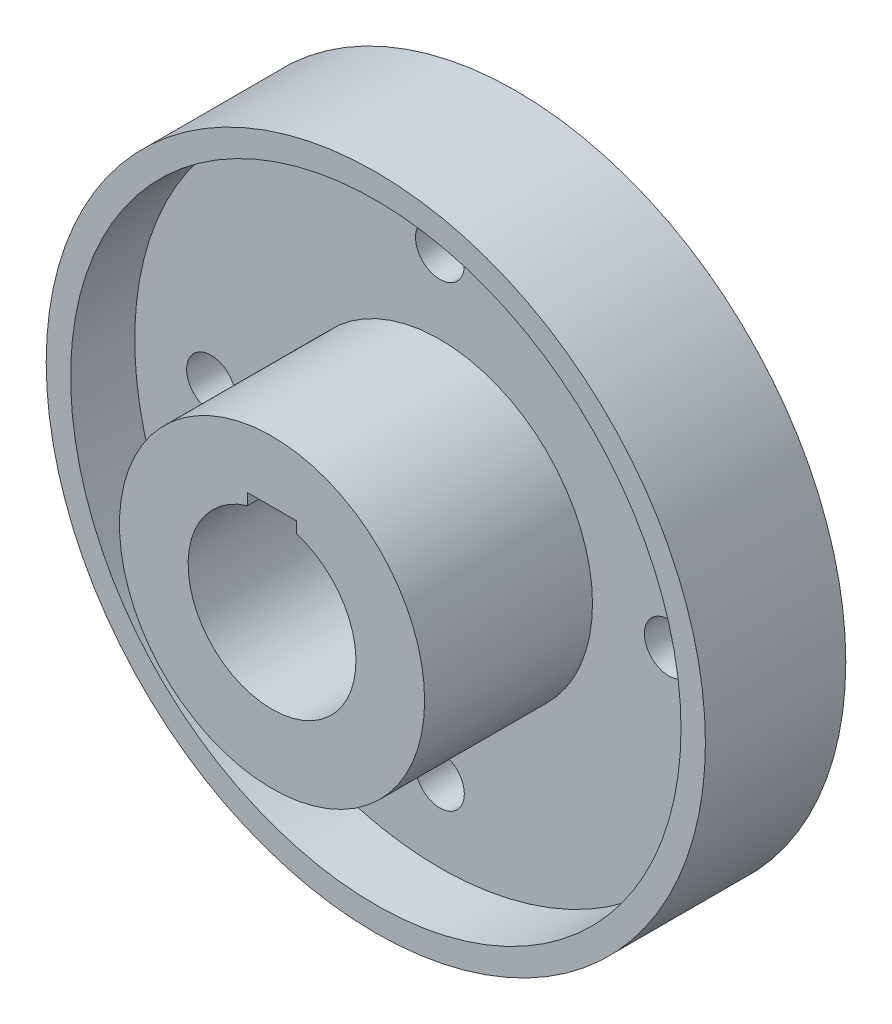
ISO-10303-21;
HEADER;
FILE_DESCRIPTION(('STEP AP214'),'2;1');
FILE_NAME('part.step','',(''),(''),'','','');
FILE_SCHEMA(('AUTOMOTIVE_DESIGN { 1 0 10303 214 1 1 1 1 }'));
ENDSEC;
DATA;
#1=APPLICATION_CONTEXT('core data for automotive mechanical design processes');
#2=APPLICATION_PROTOCOL_DEFINITION('international standard','automotive_design',2000,#1);
#3=PRODUCT_CONTEXT('',#1,'mechanical');
#4=PRODUCT('Part','Part','',(#3));
#5=PRODUCT_RELATED_PRODUCT_CATEGORY('part','',(#4));
#6=PRODUCT_DEFINITION_FORMATION('','',#4);
#7=PRODUCT_DEFINITION_CONTEXT('part definition',#1,'design');
#8=PRODUCT_DEFINITION('design','',#6,#7);
#9=PRODUCT_DEFINITION_SHAPE('','',#8);
#10=(LENGTH_UNIT() NAMED_UNIT(*) SI_UNIT(.MILLI.,.METRE.));
#11=(NAMED_UNIT(*) PLANE_ANGLE_UNIT() SI_UNIT($,.RADIAN.));
#12=(NAMED_UNIT(*) SI_UNIT($,.STERADIAN.) SOLID_ANGLE_UNIT());
#13=UNCERTAINTY_MEASURE_WITH_UNIT(LENGTH_MEASURE(1.E-05),#10,'distance_accuracy_value','');
#14=(GEOMETRIC_REPRESENTATION_CONTEXT(3) GLOBAL_UNCERTAINTY_ASSIGNED_CONTEXT((#13)) GLOBAL_UNIT_ASSIGNED_CONTEXT((#10,
#11,#12)) REPRESENTATION_CONTEXT('',''));
#15=CARTESIAN_POINT('',(0.,0.,0.));
#16=DIRECTION('',(0.,0.,1.));
#17=DIRECTION('',(1.,0.,0.));
#18=AXIS2_PLACEMENT_3D('',#15,#16,#17);
#19=CARTESIAN_POINT('',(0.,0.,25.));
#20=DIRECTION('',(0.,0.,-1.));
#21=DIRECTION('',(-1.,0.,0.));
#22=AXIS2_PLACEMENT_3D('',#19,#20,#21);
#23=CYLINDRICAL_SURFACE('',#22,108.);
#24=CARTESIAN_POINT('',(0.,0.,0.));
#25=DIRECTION('',(0.,0.,1.));
#26=DIRECTION('',(1.,0.,0.));
#27=AXIS2_PLACEMENT_3D('',#24,#25,#26);
#28=CIRCLE('',#27,108.);
#29=CARTESIAN_POINT('',(108.,0.,0.));
#30=VERTEX_POINT('',#29);
#31=EDGE_CURVE('E141',#30,#30,#28,.T.);
#32=ORIENTED_EDGE('',*,*,#31,.T.);
#33=EDGE_LOOP('',(#32));
#34=FACE_BOUND('',#33,.T.);
#35=CARTESIAN_POINT('',(0.,0.,46.));
#36=DIRECTION('',(0.,0.,1.));
#37=DIRECTION('',(1.,0.,0.));
#38=AXIS2_PLACEMENT_3D('',#35,#36,#37);
#39=CIRCLE('',#38,108.);
#40=CARTESIAN_POINT('',(108.,0.,46.));
#41=VERTEX_POINT('',#40);
#42=EDGE_CURVE('E138',#41,#41,#39,.T.);
#43=ORIENTED_EDGE('',*,*,#42,.F.);
#44=EDGE_LOOP('',(#43));
#45=FACE_BOUND('',#44,.T.);
#46=ADVANCED_FACE('F33',(#34,#45),#23,.T.);
#47=CARTESIAN_POINT('',(0.,0.,0.));
#48=DIRECTION('',(0.,0.,1.));
#49=DIRECTION('',(1.,0.,0.));
#50=AXIS2_PLACEMENT_3D('',#47,#48,#49);
#51=PLANE('',#50);
#52=CARTESIAN_POINT('',(0.,0.,0.));
#53=DIRECTION('',(0.,0.,-1.));
#54=DIRECTION('',(-1.,0.,0.));
#55=AXIS2_PLACEMENT_3D('',#52,#53,#54);
#56=CIRCLE('',#55,37.5);
#57=CARTESIAN_POINT('',(-37.5,0.,0.));
#58=VERTEX_POINT('',#57);
#59=EDGE_CURVE('E101',#58,#58,#56,.T.);
#60=ORIENTED_EDGE('',*,*,#59,.F.);
#61=EDGE_LOOP('',(#60));
#62=FACE_BOUND('',#61,.T.);
#63=CARTESIAN_POINT('',(0.,75.,0.));
#64=DIRECTION('',(0.,0.,1.));
#65=DIRECTION('',(1.,0.,0.));
#66=AXIS2_PLACEMENT_3D('',#63,#64,#65);
#67=CIRCLE('',#66,8.);
#68=CARTESIAN_POINT('',(8.,75.,0.));
#69=VERTEX_POINT('',#68);
#70=EDGE_CURVE('E104',#69,#69,#67,.T.);
#71=ORIENTED_EDGE('',*,*,#70,.T.);
#72=EDGE_LOOP('',(#71));
#73=FACE_BOUND('',#72,.T.);
#74=CARTESIAN_POINT('',(75.0000000000021,2.11785093078989E-12,0.));
#75=DIRECTION('',(0.,0.,1.));
#76=DIRECTION('',(1.,0.,0.));
#77=AXIS2_PLACEMENT_3D('',#74,#75,#76);
#78=CIRCLE('',#77,8.00000000000166);
#79=CARTESIAN_POINT('',(83.0000000000038,2.11785093078989E-12,0.));
#80=VERTEX_POINT('',#79);
#81=EDGE_CURVE('E111',#80,#80,#78,.T.);
#82=ORIENTED_EDGE('',*,*,#81,.T.);
#83=EDGE_LOOP('',(#82));
#84=FACE_BOUND('',#83,.T.);
#85=CARTESIAN_POINT('',(4.23570186157979E-12,-75.,0.));
#86=DIRECTION('',(0.,0.,1.));
#87=DIRECTION('',(1.,0.,0.));
#88=AXIS2_PLACEMENT_3D('',#85,#86,#87);
#89=CIRCLE('',#88,8.00000000000456);
#90=CARTESIAN_POINT('',(8.00000000000879,-75.,0.));
#91=VERTEX_POINT('',#90);
#92=EDGE_CURVE('E117',#91,#91,#89,.T.);
#93=ORIENTED_EDGE('',*,*,#92,.T.);
#94=EDGE_LOOP('',(#93));
#95=FACE_BOUND('',#94,.T.);
#96=CARTESIAN_POINT('',(-74.9999999999979,-2.1270357817835E-12,0.));
#97=DIRECTION('',(0.,0.,1.));
#98=DIRECTION('',(1.,0.,0.));
#99=AXIS2_PLACEMENT_3D('',#96,#97,#98);
#100=CIRCLE('',#99,8.00000000000341);
#101=CARTESIAN_POINT('',(-66.9999999999945,-2.1270357817835E-12,0.));
#102=VERTEX_POINT('',#101);
#103=EDGE_CURVE('E123',#102,#102,#100,.T.);
#104=ORIENTED_EDGE('',*,*,#103,.T.);
#105=EDGE_LOOP('',(#104));
#106=FACE_BOUND('',#105,.T.);
#107=ORIENTED_EDGE('',*,*,#31,.F.);
#108=EDGE_LOOP('',(#107));
#109=FACE_BOUND('',#108,.T.);
#110=ADVANCED_FACE('F174',(#62,#73,#84,#95,#106,#109),#51,.F.);
#111=CARTESIAN_POINT('',(0.,0.,46.));
#112=DIRECTION('',(0.,0.,1.));
#113=DIRECTION('',(1.,0.,0.));
#114=AXIS2_PLACEMENT_3D('',#111,#112,#113);
#115=PLANE('',#114);
#116=ORIENTED_EDGE('',*,*,#42,.T.);
#117=EDGE_LOOP('',(#116));
#118=FACE_BOUND('',#117,.T.);
#119=CARTESIAN_POINT('',(0.,0.,46.));
#120=DIRECTION('',(0.,0.,1.));
#121=DIRECTION('',(1.,0.,0.));
#122=AXIS2_PLACEMENT_3D('',#119,#120,#121);
#123=CIRCLE('',#122,100.);
#124=CARTESIAN_POINT('',(100.,0.,46.));
#125=VERTEX_POINT('',#124);
#126=EDGE_CURVE('E133',#125,#125,#123,.T.);
#127=ORIENTED_EDGE('',*,*,#126,.F.);
#128=EDGE_LOOP('',(#127));
#129=FACE_BOUND('',#128,.T.);
#130=ADVANCED_FACE('F179',(#118,#129),#115,.T.);
#131=CARTESIAN_POINT('',(0.,0.,46.));
#132=DIRECTION('',(0.,0.,-1.));
#133=DIRECTION('',(-1.,0.,0.));
#134=AXIS2_PLACEMENT_3D('',#131,#132,#133);
#135=CYLINDRICAL_SURFACE('',#134,100.);
#136=ORIENTED_EDGE('',*,*,#126,.T.);
#137=EDGE_LOOP('',(#136));
#138=FACE_BOUND('',#137,.T.);
#139=CARTESIAN_POINT('',(0.,0.,25.));
#140=DIRECTION('',(0.,0.,1.));
#141=DIRECTION('',(1.,0.,0.));
#142=AXIS2_PLACEMENT_3D('',#139,#140,#141);
#143=CIRCLE('',#142,100.);
#144=CARTESIAN_POINT('',(100.,0.,25.));
#145=VERTEX_POINT('',#144);
#146=EDGE_CURVE('E144',#145,#145,#143,.F.);
#147=ORIENTED_EDGE('',*,*,#146,.T.);
#148=EDGE_LOOP('',(#147));
#149=FACE_BOUND('',#148,.T.);
#150=ADVANCED_FACE('F187',(#138,#149),#135,.F.);
#151=CARTESIAN_POINT('',(0.,0.,25.));
#152=DIRECTION('',(0.,0.,1.));
#153=DIRECTION('',(1.,0.,0.));
#154=AXIS2_PLACEMENT_3D('',#151,#152,#153);
#155=PLANE('',#154);
#156=CARTESIAN_POINT('',(0.,75.,25.));
#157=DIRECTION('',(0.,0.,1.));
#158=DIRECTION('',(1.,0.,0.));
#159=AXIS2_PLACEMENT_3D('',#156,#157,#158);
#160=CIRCLE('',#159,8.);
#161=CARTESIAN_POINT('',(8.,75.,25.));
#162=VERTEX_POINT('',#161);
#163=EDGE_CURVE('E108',#162,#162,#160,.T.);
#164=ORIENTED_EDGE('',*,*,#163,.F.);
#165=EDGE_LOOP('',(#164));
#166=FACE_BOUND('',#165,.T.);
#167=CARTESIAN_POINT('',(75.0000000000021,2.11785093078989E-12,25.));
#168=DIRECTION('',(0.,0.,1.));
#169=DIRECTION('',(1.,0.,0.));
#170=AXIS2_PLACEMENT_3D('',#167,#168,#169);
#171=CIRCLE('',#170,8.00000000000166);
#172=CARTESIAN_POINT('',(83.0000000000038,2.11785093078989E-12,25.));
#173=VERTEX_POINT('',#172);
#174=EDGE_CURVE('E114',#173,#173,#171,.T.);
#175=ORIENTED_EDGE('',*,*,#174,.F.);
#176=EDGE_LOOP('',(#175));
#177=FACE_BOUND('',#176,.T.);
#178=CARTESIAN_POINT('',(4.23570186157979E-12,-75.,25.));
#179=DIRECTION('',(0.,0.,1.));
#180=DIRECTION('',(1.,0.,0.));
#181=AXIS2_PLACEMENT_3D('',#178,#179,#180);
#182=CIRCLE('',#181,8.00000000000456);
#183=CARTESIAN_POINT('',(8.00000000000879,-75.,25.));
#184=VERTEX_POINT('',#183);
#185=EDGE_CURVE('E120',#184,#184,#182,.T.);
#186=ORIENTED_EDGE('',*,*,#185,.F.);
#187=EDGE_LOOP('',(#186));
#188=FACE_BOUND('',#187,.T.);
#189=CARTESIAN_POINT('',(-74.9999999999979,-2.1270357817835E-12,25.));
#190=DIRECTION('',(0.,0.,1.));
#191=DIRECTION('',(1.,0.,0.));
#192=AXIS2_PLACEMENT_3D('',#189,#190,#191);
#193=CIRCLE('',#192,8.00000000000341);
#194=CARTESIAN_POINT('',(-66.9999999999945,-2.1270357817835E-12,25.));
#195=VERTEX_POINT('',#194);
#196=EDGE_CURVE('E100',#195,#195,#193,.T.);
#197=ORIENTED_EDGE('',*,*,#196,.F.);
#198=EDGE_LOOP('',(#197));
#199=FACE_BOUND('',#198,.T.);
#200=CARTESIAN_POINT('',(0.,0.,25.));
#201=DIRECTION('',(0.,0.,1.));
#202=DIRECTION('',(1.,0.,0.));
#203=AXIS2_PLACEMENT_3D('',#200,#201,#202);
#204=CIRCLE('',#203,50.);
#205=CARTESIAN_POINT('',(50.,0.,25.));
#206=VERTEX_POINT('',#205);
#207=EDGE_CURVE('E129',#206,#206,#204,.T.);
#208=ORIENTED_EDGE('',*,*,#207,.F.);
#209=EDGE_LOOP('',(#208));
#210=FACE_BOUND('',#209,.T.);
#211=ORIENTED_EDGE('',*,*,#146,.F.);
#212=EDGE_LOOP('',(#211));
#213=FACE_BOUND('',#212,.T.);
#214=ADVANCED_FACE('F193',(#166,#177,#188,#199,#210,#213),#155,.T.);
#215=CARTESIAN_POINT('',(0.,0.,80.));
#216=DIRECTION('',(0.,0.,1.));
#217=DIRECTION('',(1.,0.,0.));
#218=AXIS2_PLACEMENT_3D('',#215,#216,#217);
#219=PLANE('',#218);
#220=DIRECTION('',(0.,1.,0.));
#221=VECTOR('',#220,1.);
#222=CARTESIAN_POINT('',(8.,0.,80.));
#223=LINE('',#222,#221);
#224=CARTESIAN_POINT('',(8.,26.3106442338457,80.));
#225=VERTEX_POINT('',#224);
#226=CARTESIAN_POINT('',(8.,30.,80.));
#227=VERTEX_POINT('',#226);
#228=EDGE_CURVE('E70',#225,#227,#223,.T.);
#229=ORIENTED_EDGE('',*,*,#228,.F.);
#230=CARTESIAN_POINT('',(0.,0.,80.));
#231=DIRECTION('',(0.,0.,1.));
#232=DIRECTION('',(1.,0.,0.));
#233=AXIS2_PLACEMENT_3D('',#230,#231,#232);
#234=CIRCLE('',#233,27.5);
#235=CARTESIAN_POINT('',(-8.,26.3106442338457,80.));
#236=VERTEX_POINT('',#235);
#237=EDGE_CURVE('E107',#236,#225,#234,.T.);
#238=ORIENTED_EDGE('',*,*,#237,.F.);
#239=DIRECTION('',(0.,-1.,0.));
#240=VECTOR('',#239,1.);
#241=CARTESIAN_POINT('',(-8.,30.,80.));
#242=LINE('',#241,#240);
#243=CARTESIAN_POINT('',(-8.,30.,80.));
#244=VERTEX_POINT('',#243);
#245=EDGE_CURVE('E85',#244,#236,#242,.T.);
#246=ORIENTED_EDGE('',*,*,#245,.F.);
#247=DIRECTION('',(-1.,0.,0.));
#248=VECTOR('',#247,1.);
#249=CARTESIAN_POINT('',(-8.,30.,80.));
#250=LINE('',#249,#248);
#251=EDGE_CURVE('E79',#227,#244,#250,.T.);
#252=ORIENTED_EDGE('',*,*,#251,.F.);
#253=EDGE_LOOP('',(#229,#238,#246,#252));
#254=FACE_BOUND('',#253,.T.);
#255=CARTESIAN_POINT('',(0.,0.,80.));
#256=DIRECTION('',(0.,0.,1.));
#257=DIRECTION('',(1.,0.,0.));
#258=AXIS2_PLACEMENT_3D('',#255,#256,#257);
#259=CIRCLE('',#258,50.);
#260=CARTESIAN_POINT('',(50.,0.,80.));
#261=VERTEX_POINT('',#260);
#262=EDGE_CURVE('E130',#261,#261,#259,.T.);
#263=ORIENTED_EDGE('',*,*,#262,.T.);
#264=EDGE_LOOP('',(#263));
#265=FACE_BOUND('',#264,.T.);
#266=ADVANCED_FACE('F87',(#254,#265),#219,.T.);
#267=CARTESIAN_POINT('',(0.,0.,80.));
#268=DIRECTION('',(0.,0.,-1.));
#269=DIRECTION('',(-1.,0.,0.));
#270=AXIS2_PLACEMENT_3D('',#267,#268,#269);
#271=CYLINDRICAL_SURFACE('',#270,50.);
#272=ORIENTED_EDGE('',*,*,#262,.F.);
#273=EDGE_LOOP('',(#272));
#274=FACE_BOUND('',#273,.T.);
#275=ORIENTED_EDGE('',*,*,#207,.T.);
#276=EDGE_LOOP('',(#275));
#277=FACE_BOUND('',#276,.T.);
#278=ADVANCED_FACE('F161',(#274,#277),#271,.T.);
#279=CARTESIAN_POINT('',(0.,0.,80.));
#280=DIRECTION('',(0.,0.,-1.));
#281=DIRECTION('',(-1.,0.,0.));
#282=AXIS2_PLACEMENT_3D('',#279,#280,#281);
#283=CYLINDRICAL_SURFACE('',#282,27.5);
#284=DIRECTION('',(0.,0.,-1.));
#285=VECTOR('',#284,1.);
#286=CARTESIAN_POINT('',(8.,26.3106442338457,80.));
#287=LINE('',#286,#285);
#288=CARTESIAN_POINT('',(8.,26.3106442338457,6.));
#289=VERTEX_POINT('',#288);
#290=EDGE_CURVE('E74',#289,#225,#287,.F.);
#291=ORIENTED_EDGE('',*,*,#290,.F.);
#292=CARTESIAN_POINT('',(0.,0.,6.));
#293=DIRECTION('',(0.,0.,-1.));
#294=DIRECTION('',(-1.,0.,0.));
#295=AXIS2_PLACEMENT_3D('',#292,#293,#294);
#296=CIRCLE('',#295,27.5);
#297=CARTESIAN_POINT('',(-8.,26.3106442338457,6.));
#298=VERTEX_POINT('',#297);
#299=EDGE_CURVE('E96',#289,#298,#296,.T.);
#300=ORIENTED_EDGE('',*,*,#299,.T.);
#301=DIRECTION('',(0.,0.,-1.));
#302=VECTOR('',#301,1.);
#303=CARTESIAN_POINT('',(-8.,26.3106442338457,80.));
#304=LINE('',#303,#302);
#305=EDGE_CURVE('E92',#236,#298,#304,.T.);
#306=ORIENTED_EDGE('',*,*,#305,.F.);
#307=ORIENTED_EDGE('',*,*,#237,.T.);
#308=EDGE_LOOP('',(#291,#300,#306,#307));
#309=FACE_BOUND('',#308,.T.);
#310=ADVANCED_FACE('F158',(#309),#283,.F.);
#311=CARTESIAN_POINT('',(-74.9999999999979,-2.1270357817835E-12,0.));
#312=DIRECTION('',(0.,0.,1.));
#313=DIRECTION('',(1.,0.,0.));
#314=AXIS2_PLACEMENT_3D('',#311,#312,#313);
#315=CYLINDRICAL_SURFACE('',#314,8.00000000000341);
#316=ORIENTED_EDGE('',*,*,#103,.F.);
#317=EDGE_LOOP('',(#316));
#318=FACE_BOUND('',#317,.T.);
#319=ORIENTED_EDGE('',*,*,#196,.T.);
#320=EDGE_LOOP('',(#319));
#321=FACE_BOUND('',#320,.T.);
#322=ADVANCED_FACE('F160',(#318,#321),#315,.F.);
#323=CARTESIAN_POINT('',(4.23570186157979E-12,-75.,0.));
#324=DIRECTION('',(0.,0.,1.));
#325=DIRECTION('',(1.,0.,0.));
#326=AXIS2_PLACEMENT_3D('',#323,#324,#325);
#327=CYLINDRICAL_SURFACE('',#326,8.00000000000456);
#328=ORIENTED_EDGE('',*,*,#92,.F.);
#329=EDGE_LOOP('',(#328));
#330=FACE_BOUND('',#329,.T.);
#331=ORIENTED_EDGE('',*,*,#185,.T.);
#332=EDGE_LOOP('',(#331));
#333=FACE_BOUND('',#332,.T.);
#334=ADVANCED_FACE('F167',(#330,#333),#327,.F.);
#335=CARTESIAN_POINT('',(75.0000000000021,2.11785093078989E-12,0.));
#336=DIRECTION('',(0.,0.,1.));
#337=DIRECTION('',(1.,0.,0.));
#338=AXIS2_PLACEMENT_3D('',#335,#336,#337);
#339=CYLINDRICAL_SURFACE('',#338,8.00000000000166);
#340=ORIENTED_EDGE('',*,*,#81,.F.);
#341=EDGE_LOOP('',(#340));
#342=FACE_BOUND('',#341,.T.);
#343=ORIENTED_EDGE('',*,*,#174,.T.);
#344=EDGE_LOOP('',(#343));
#345=FACE_BOUND('',#344,.T.);
#346=ADVANCED_FACE('F216',(#342,#345),#339,.F.);
#347=CARTESIAN_POINT('',(0.,75.,0.));
#348=DIRECTION('',(0.,0.,1.));
#349=DIRECTION('',(1.,0.,0.));
#350=AXIS2_PLACEMENT_3D('',#347,#348,#349);
#351=CYLINDRICAL_SURFACE('',#350,8.);
#352=ORIENTED_EDGE('',*,*,#70,.F.);
#353=EDGE_LOOP('',(#352));
#354=FACE_BOUND('',#353,.T.);
#355=ORIENTED_EDGE('',*,*,#163,.T.);
#356=EDGE_LOOP('',(#355));
#357=FACE_BOUND('',#356,.T.);
#358=ADVANCED_FACE('F222',(#354,#357),#351,.F.);
#359=CARTESIAN_POINT('',(0.,0.,6.));
#360=DIRECTION('',(0.,0.,-1.));
#361=DIRECTION('',(-1.,0.,0.));
#362=AXIS2_PLACEMENT_3D('',#359,#360,#361);
#363=CYLINDRICAL_SURFACE('',#362,37.5);
#364=CARTESIAN_POINT('',(0.,0.,6.));
#365=DIRECTION('',(0.,0.,-1.));
#366=DIRECTION('',(-1.,0.,0.));
#367=AXIS2_PLACEMENT_3D('',#364,#365,#366);
#368=CIRCLE('',#367,37.5);
#369=CARTESIAN_POINT('',(-37.5,0.,6.));
#370=VERTEX_POINT('',#369);
#371=EDGE_CURVE('E97',#370,#370,#368,.T.);
#372=ORIENTED_EDGE('',*,*,#371,.F.);
#373=EDGE_LOOP('',(#372));
#374=FACE_BOUND('',#373,.T.);
#375=ORIENTED_EDGE('',*,*,#59,.T.);
#376=EDGE_LOOP('',(#375));
#377=FACE_BOUND('',#376,.T.);
#378=ADVANCED_FACE('F229',(#374,#377),#363,.F.);
#379=CARTESIAN_POINT('',(0.,0.,6.));
#380=DIRECTION('',(0.,0.,-1.));
#381=DIRECTION('',(-1.,0.,0.));
#382=AXIS2_PLACEMENT_3D('',#379,#380,#381);
#383=PLANE('',#382);
#384=DIRECTION('',(0.,-1.,0.));
#385=VECTOR('',#384,1.);
#386=CARTESIAN_POINT('',(8.,0.,6.));
#387=LINE('',#386,#385);
#388=CARTESIAN_POINT('',(8.,30.,6.));
#389=VERTEX_POINT('',#388);
#390=EDGE_CURVE('E11',#389,#289,#387,.T.);
#391=ORIENTED_EDGE('',*,*,#390,.F.);
#392=DIRECTION('',(1.,0.,0.));
#393=VECTOR('',#392,1.);
#394=CARTESIAN_POINT('',(0.,30.,6.));
#395=LINE('',#394,#393);
#396=CARTESIAN_POINT('',(-8.,30.,6.));
#397=VERTEX_POINT('',#396);
#398=EDGE_CURVE('E84',#397,#389,#395,.T.);
#399=ORIENTED_EDGE('',*,*,#398,.F.);
#400=DIRECTION('',(0.,1.,0.));
#401=VECTOR('',#400,1.);
#402=CARTESIAN_POINT('',(-8.,0.,6.));
#403=LINE('',#402,#401);
#404=EDGE_CURVE('E40',#298,#397,#403,.T.);
#405=ORIENTED_EDGE('',*,*,#404,.F.);
#406=ORIENTED_EDGE('',*,*,#299,.F.);
#407=EDGE_LOOP('',(#391,#399,#405,#406));
#408=FACE_BOUND('',#407,.T.);
#409=ORIENTED_EDGE('',*,*,#371,.T.);
#410=EDGE_LOOP('',(#409));
#411=FACE_BOUND('',#410,.T.);
#412=ADVANCED_FACE('F155',(#408,#411),#383,.T.);
#413=CARTESIAN_POINT('',(8.,0.,0.));
#414=DIRECTION('',(1.,0.,0.));
#415=DIRECTION('',(0.,0.,-1.));
#416=AXIS2_PLACEMENT_3D('',#413,#414,#415);
#417=PLANE('',#416);
#418=ORIENTED_EDGE('',*,*,#290,.T.);
#419=ORIENTED_EDGE('',*,*,#228,.T.);
#420=DIRECTION('',(0.,0.,1.));
#421=VECTOR('',#420,1.);
#422=CARTESIAN_POINT('',(8.,30.,0.));
#423=LINE('',#422,#421);
#424=EDGE_CURVE('E73',#389,#227,#423,.T.);
#425=ORIENTED_EDGE('',*,*,#424,.F.);
#426=ORIENTED_EDGE('',*,*,#390,.T.);
#427=EDGE_LOOP('',(#418,#419,#425,#426));
#428=FACE_BOUND('',#427,.T.);
#429=ADVANCED_FACE('F72',(#428),#417,.F.);
#430=CARTESIAN_POINT('',(-8.,30.,0.));
#431=DIRECTION('',(-1.,0.,0.));
#432=DIRECTION('',(0.,0.,1.));
#433=AXIS2_PLACEMENT_3D('',#430,#431,#432);
#434=PLANE('',#433);
#435=ORIENTED_EDGE('',*,*,#305,.T.);
#436=ORIENTED_EDGE('',*,*,#404,.T.);
#437=DIRECTION('',(0.,0.,1.));
#438=VECTOR('',#437,1.);
#439=CARTESIAN_POINT('',(-8.,30.,0.));
#440=LINE('',#439,#438);
#441=EDGE_CURVE('E47',#397,#244,#440,.T.);
#442=ORIENTED_EDGE('',*,*,#441,.T.);
#443=ORIENTED_EDGE('',*,*,#245,.T.);
#444=EDGE_LOOP('',(#435,#436,#442,#443));
#445=FACE_BOUND('',#444,.T.);
#446=ADVANCED_FACE('F151',(#445),#434,.F.);
#447=CARTESIAN_POINT('',(-8.,30.,0.));
#448=DIRECTION('',(0.,1.,0.));
#449=DIRECTION('',(-1.,0.,0.));
#450=AXIS2_PLACEMENT_3D('',#447,#448,#449);
#451=PLANE('',#450);
#452=ORIENTED_EDGE('',*,*,#398,.T.);
#453=ORIENTED_EDGE('',*,*,#424,.T.);
#454=ORIENTED_EDGE('',*,*,#251,.T.);
#455=ORIENTED_EDGE('',*,*,#441,.F.);
#456=EDGE_LOOP('',(#452,#453,#454,#455));
#457=FACE_BOUND('',#456,.T.);
#458=ADVANCED_FACE('F81',(#457),#451,.F.);
#459=CLOSED_SHELL('',(#46,#110,#130,#150,#214,#266,#278,#310,#322,#334,#346,#358,#378,#412,#429,
#446,#458));
#460=MANIFOLD_SOLID_BREP('B2',#459);
#461=ADVANCED_BREP_SHAPE_REPRESENTATION('',(#18,#460),#14);
#462=SHAPE_DEFINITION_REPRESENTATION(#9,#461);
ENDSEC;
END-ISO-10303-21;
